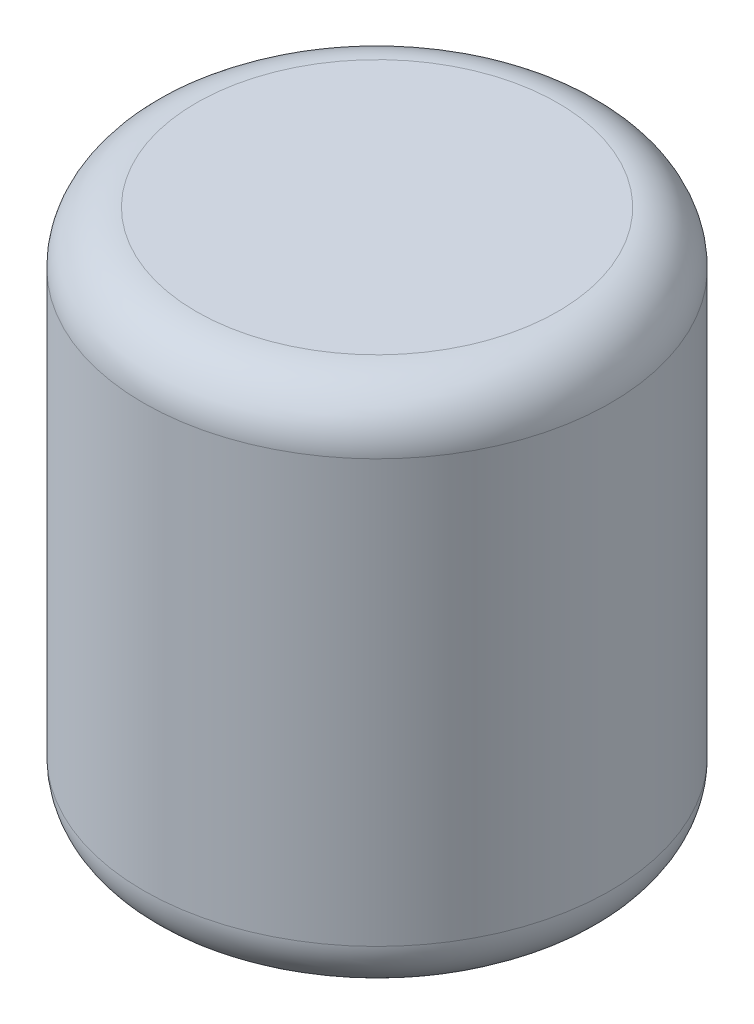
ISO-10303-21;
HEADER;
FILE_DESCRIPTION(('STEP AP214'),'2;1');
FILE_NAME('part.step','',(''),(''),'','','');
FILE_SCHEMA(('AUTOMOTIVE_DESIGN { 1 0 10303 214 1 1 1 1 }'));
ENDSEC;
DATA;
#1=APPLICATION_CONTEXT('core data for automotive mechanical design processes');
#2=APPLICATION_PROTOCOL_DEFINITION('international standard','automotive_design',2000,#1);
#3=PRODUCT_CONTEXT('',#1,'mechanical');
#4=PRODUCT('Part','Part','',(#3));
#5=PRODUCT_RELATED_PRODUCT_CATEGORY('part','',(#4));
#6=PRODUCT_DEFINITION_FORMATION('','',#4);
#7=PRODUCT_DEFINITION_CONTEXT('part definition',#1,'design');
#8=PRODUCT_DEFINITION('design','',#6,#7);
#9=PRODUCT_DEFINITION_SHAPE('','',#8);
#10=(LENGTH_UNIT() NAMED_UNIT(*) SI_UNIT(.MILLI.,.METRE.));
#11=(NAMED_UNIT(*) PLANE_ANGLE_UNIT() SI_UNIT($,.RADIAN.));
#12=(NAMED_UNIT(*) SI_UNIT($,.STERADIAN.) SOLID_ANGLE_UNIT());
#13=UNCERTAINTY_MEASURE_WITH_UNIT(LENGTH_MEASURE(1.E-05),#10,'distance_accuracy_value','');
#14=(GEOMETRIC_REPRESENTATION_CONTEXT(3) GLOBAL_UNCERTAINTY_ASSIGNED_CONTEXT((#13)) GLOBAL_UNIT_ASSIGNED_CONTEXT((#10,
#11,#12)) REPRESENTATION_CONTEXT('',''));
#15=CARTESIAN_POINT('',(0.,0.,0.));
#16=DIRECTION('',(0.,0.,1.));
#17=DIRECTION('',(1.,0.,0.));
#18=AXIS2_PLACEMENT_3D('',#15,#16,#17);
#19=CARTESIAN_POINT('',(0.,100.,0.));
#20=DIRECTION('',(0.,-1.,0.));
#21=DIRECTION('',(0.,0.,-1.));
#22=AXIS2_PLACEMENT_3D('',#19,#20,#21);
#23=CYLINDRICAL_SURFACE('',#22,44.25);
#24=CARTESIAN_POINT('',(0.,90.,0.));
#25=DIRECTION('',(0.,1.,0.));
#26=DIRECTION('',(0.,0.,1.));
#27=AXIS2_PLACEMENT_3D('',#24,#25,#26);
#28=CIRCLE('',#27,44.25);
#29=CARTESIAN_POINT('',(0.,90.,44.25));
#30=VERTEX_POINT('',#29);
#31=EDGE_CURVE('E38',#30,#30,#28,.F.);
#32=ORIENTED_EDGE('',*,*,#31,.T.);
#33=EDGE_LOOP('',(#32));
#34=FACE_BOUND('',#33,.T.);
#35=CARTESIAN_POINT('',(0.,9.99999999999998,0.));
#36=DIRECTION('',(0.,1.,0.));
#37=DIRECTION('',(0.,0.,1.));
#38=AXIS2_PLACEMENT_3D('',#35,#36,#37);
#39=CIRCLE('',#38,44.25);
#40=CARTESIAN_POINT('',(0.,9.99999999999998,44.25));
#41=VERTEX_POINT('',#40);
#42=EDGE_CURVE('E42',#41,#41,#39,.T.);
#43=ORIENTED_EDGE('',*,*,#42,.T.);
#44=EDGE_LOOP('',(#43));
#45=FACE_BOUND('',#44,.T.);
#46=ADVANCED_FACE('F31',(#34,#45),#23,.T.);
#47=CARTESIAN_POINT('',(0.,100.,0.));
#48=DIRECTION('',(0.,1.,0.));
#49=DIRECTION('',(0.,0.,1.));
#50=AXIS2_PLACEMENT_3D('',#47,#48,#49);
#51=PLANE('',#50);
#52=CARTESIAN_POINT('',(0.,100.,0.));
#53=DIRECTION('',(0.,1.,0.));
#54=DIRECTION('',(0.,0.,1.));
#55=AXIS2_PLACEMENT_3D('',#52,#53,#54);
#56=CIRCLE('',#55,34.25);
#57=CARTESIAN_POINT('',(0.,100.,34.25));
#58=VERTEX_POINT('',#57);
#59=EDGE_CURVE('E46',#58,#58,#56,.T.);
#60=ORIENTED_EDGE('',*,*,#59,.T.);
#61=EDGE_LOOP('',(#60));
#62=FACE_BOUND('',#61,.T.);
#63=ADVANCED_FACE('F52',(#62),#51,.T.);
#64=CARTESIAN_POINT('',(0.,0.,0.));
#65=DIRECTION('',(0.,1.,0.));
#66=DIRECTION('',(0.,0.,1.));
#67=AXIS2_PLACEMENT_3D('',#64,#65,#66);
#68=PLANE('',#67);
#69=CARTESIAN_POINT('',(0.,0.,0.));
#70=DIRECTION('',(0.,1.,0.));
#71=DIRECTION('',(0.,0.,1.));
#72=AXIS2_PLACEMENT_3D('',#69,#70,#71);
#73=CIRCLE('',#72,34.25);
#74=CARTESIAN_POINT('',(0.,0.,34.25));
#75=VERTEX_POINT('',#74);
#76=EDGE_CURVE('E10',#75,#75,#73,.F.);
#77=ORIENTED_EDGE('',*,*,#76,.T.);
#78=EDGE_LOOP('',(#77));
#79=FACE_BOUND('',#78,.T.);
#80=ADVANCED_FACE('F56',(#79),#68,.F.);
#81=CARTESIAN_POINT('',(0.,90.,0.));
#82=DIRECTION('',(0.,1.,0.));
#83=DIRECTION('',(0.,0.,1.));
#84=AXIS2_PLACEMENT_3D('',#81,#82,#83);
#85=TOROIDAL_SURFACE('',#84,34.25,10.);
#86=ORIENTED_EDGE('',*,*,#31,.F.);
#87=EDGE_LOOP('',(#86));
#88=FACE_BOUND('',#87,.T.);
#89=ORIENTED_EDGE('',*,*,#59,.F.);
#90=EDGE_LOOP('',(#89));
#91=FACE_BOUND('',#90,.T.);
#92=ADVANCED_FACE('F54',(#88,#91),#85,.T.);
#93=CARTESIAN_POINT('',(0.,9.99999999999999,0.));
#94=DIRECTION('',(0.,1.,0.));
#95=DIRECTION('',(0.,0.,1.));
#96=AXIS2_PLACEMENT_3D('',#93,#94,#95);
#97=TOROIDAL_SURFACE('',#96,34.25,10.);
#98=ORIENTED_EDGE('',*,*,#76,.F.);
#99=EDGE_LOOP('',(#98));
#100=FACE_BOUND('',#99,.T.);
#101=ORIENTED_EDGE('',*,*,#42,.F.);
#102=EDGE_LOOP('',(#101));
#103=FACE_BOUND('',#102,.T.);
#104=ADVANCED_FACE('F33',(#100,#103),#97,.T.);
#105=CLOSED_SHELL('',(#46,#63,#80,#92,#104));
#106=MANIFOLD_SOLID_BREP('B2',#105);
#107=ADVANCED_BREP_SHAPE_REPRESENTATION('',(#18,#106),#14);
#108=SHAPE_DEFINITION_REPRESENTATION(#9,#107);
ENDSEC;
END-ISO-10303-21;
